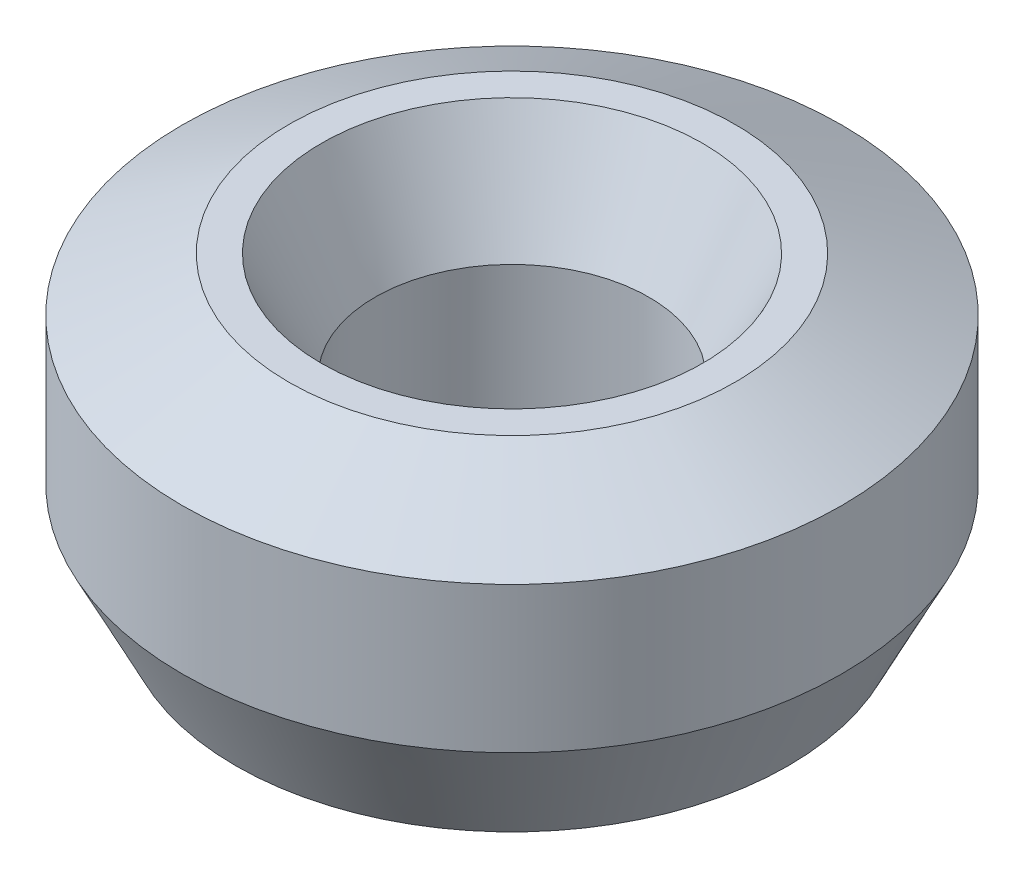
ISO-10303-21;
HEADER;
FILE_DESCRIPTION(('STEP AP214'),'2;1');
FILE_NAME('part.step','',(''),(''),'','','');
FILE_SCHEMA(('AUTOMOTIVE_DESIGN { 1 0 10303 214 1 1 1 1 }'));
ENDSEC;
DATA;
#1=APPLICATION_CONTEXT('core data for automotive mechanical design processes');
#2=APPLICATION_PROTOCOL_DEFINITION('international standard','automotive_design',2000,#1);
#3=PRODUCT_CONTEXT('',#1,'mechanical');
#4=PRODUCT('Part','Part','',(#3));
#5=PRODUCT_RELATED_PRODUCT_CATEGORY('part','',(#4));
#6=PRODUCT_DEFINITION_FORMATION('','',#4);
#7=PRODUCT_DEFINITION_CONTEXT('part definition',#1,'design');
#8=PRODUCT_DEFINITION('design','',#6,#7);
#9=PRODUCT_DEFINITION_SHAPE('','',#8);
#10=(LENGTH_UNIT() NAMED_UNIT(*) SI_UNIT(.MILLI.,.METRE.));
#11=(NAMED_UNIT(*) PLANE_ANGLE_UNIT() SI_UNIT($,.RADIAN.));
#12=(NAMED_UNIT(*) SI_UNIT($,.STERADIAN.) SOLID_ANGLE_UNIT());
#13=UNCERTAINTY_MEASURE_WITH_UNIT(LENGTH_MEASURE(1.E-05),#10,'distance_accuracy_value','');
#14=(GEOMETRIC_REPRESENTATION_CONTEXT(3) GLOBAL_UNCERTAINTY_ASSIGNED_CONTEXT((#13)) GLOBAL_UNIT_ASSIGNED_CONTEXT((#10,
#11,#12)) REPRESENTATION_CONTEXT('',''));
#15=CARTESIAN_POINT('',(0.,0.,0.));
#16=DIRECTION('',(0.,0.,1.));
#17=DIRECTION('',(1.,0.,0.));
#18=AXIS2_PLACEMENT_3D('',#15,#16,#17);
#19=CARTESIAN_POINT('',(0.,16.2372618675836,0.));
#20=DIRECTION('',(0.,-1.,0.));
#21=DIRECTION('',(0.,0.,-1.));
#22=AXIS2_PLACEMENT_3D('',#19,#20,#21);
#23=CYLINDRICAL_SURFACE('',#22,17.5);
#24=CARTESIAN_POINT('',(0.,5.65059288339666,0.));
#25=DIRECTION('',(0.,1.,0.));
#26=DIRECTION('',(0.,0.,1.));
#27=AXIS2_PLACEMENT_3D('',#24,#25,#26);
#28=CIRCLE('',#27,17.5);
#29=CARTESIAN_POINT('',(0.,5.65059288339666,17.5));
#30=VERTEX_POINT('',#29);
#31=EDGE_CURVE('E10',#30,#30,#28,.T.);
#32=ORIENTED_EDGE('',*,*,#31,.T.);
#33=EDGE_LOOP('',(#32));
#34=FACE_BOUND('',#33,.T.);
#35=CARTESIAN_POINT('',(0.,13.390682589658,0.));
#36=DIRECTION('',(0.,1.,0.));
#37=DIRECTION('',(0.,0.,1.));
#38=AXIS2_PLACEMENT_3D('',#35,#36,#37);
#39=CIRCLE('',#38,17.5);
#40=CARTESIAN_POINT('',(0.,13.390682589658,17.5));
#41=VERTEX_POINT('',#40);
#42=EDGE_CURVE('E50',#41,#41,#39,.F.);
#43=ORIENTED_EDGE('',*,*,#42,.T.);
#44=EDGE_LOOP('',(#43));
#45=FACE_BOUND('',#44,.T.);
#46=ADVANCED_FACE('F39',(#34,#45),#23,.T.);
#47=CARTESIAN_POINT('',(0.,16.2372618675836,0.));
#48=DIRECTION('',(0.,1.,0.));
#49=DIRECTION('',(0.,0.,1.));
#50=AXIS2_PLACEMENT_3D('',#47,#48,#49);
#51=PLANE('',#50);
#52=CARTESIAN_POINT('',(0.,16.2372618675836,0.));
#53=DIRECTION('',(0.,1.,0.));
#54=DIRECTION('',(0.,0.,1.));
#55=AXIS2_PLACEMENT_3D('',#52,#53,#54);
#56=CIRCLE('',#55,10.1187402259934);
#57=CARTESIAN_POINT('',(0.,16.2372618675836,10.1187402259934));
#58=VERTEX_POINT('',#57);
#59=EDGE_CURVE('E58',#58,#58,#56,.F.);
#60=ORIENTED_EDGE('',*,*,#59,.T.);
#61=EDGE_LOOP('',(#60));
#62=FACE_BOUND('',#61,.T.);
#63=CARTESIAN_POINT('',(0.,16.2372618675836,0.));
#64=DIRECTION('',(0.,1.,0.));
#65=DIRECTION('',(0.,0.,1.));
#66=AXIS2_PLACEMENT_3D('',#63,#64,#65);
#67=CIRCLE('',#66,11.8494071166033);
#68=CARTESIAN_POINT('',(0.,16.2372618675836,11.8494071166033));
#69=VERTEX_POINT('',#68);
#70=EDGE_CURVE('E61',#69,#69,#67,.T.);
#71=ORIENTED_EDGE('',*,*,#70,.T.);
#72=EDGE_LOOP('',(#71));
#73=FACE_BOUND('',#72,.T.);
#74=ADVANCED_FACE('F88',(#62,#73),#51,.T.);
#75=CARTESIAN_POINT('',(0.,0.,0.));
#76=DIRECTION('',(0.,1.,0.));
#77=DIRECTION('',(0.,0.,1.));
#78=AXIS2_PLACEMENT_3D('',#75,#76,#77);
#79=PLANE('',#78);
#80=CARTESIAN_POINT('',(0.,0.,0.));
#81=DIRECTION('',(0.,1.,0.));
#82=DIRECTION('',(0.,0.,1.));
#83=AXIS2_PLACEMENT_3D('',#80,#81,#82);
#84=CIRCLE('',#83,12.9227538314645);
#85=CARTESIAN_POINT('',(0.,0.,12.9227538314645));
#86=VERTEX_POINT('',#85);
#87=EDGE_CURVE('E51',#86,#86,#84,.T.);
#88=ORIENTED_EDGE('',*,*,#87,.T.);
#89=EDGE_LOOP('',(#88));
#90=FACE_BOUND('',#89,.T.);
#91=CARTESIAN_POINT('',(0.,0.,0.));
#92=DIRECTION('',(0.,1.,0.));
#93=DIRECTION('',(0.,0.,1.));
#94=AXIS2_PLACEMENT_3D('',#91,#92,#93);
#95=CIRCLE('',#94,14.6534207220744);
#96=CARTESIAN_POINT('',(0.,0.,14.6534207220744));
#97=VERTEX_POINT('',#96);
#98=EDGE_CURVE('E54',#97,#97,#95,.F.);
#99=ORIENTED_EDGE('',*,*,#98,.T.);
#100=EDGE_LOOP('',(#99));
#101=FACE_BOUND('',#100,.T.);
#102=ADVANCED_FACE('F83',(#90,#101),#79,.F.);
#103=CARTESIAN_POINT('',(0.,16.2372618675836,0.));
#104=DIRECTION('',(0.,-1.,0.));
#105=DIRECTION('',(0.,0.,-1.));
#106=AXIS2_PLACEMENT_3D('',#103,#104,#105);
#107=CYLINDRICAL_SURFACE('',#106,7.2721609480678);
#108=CARTESIAN_POINT('',(0.,10.5866689841869,0.));
#109=DIRECTION('',(0.,1.,0.));
#110=DIRECTION('',(0.,0.,1.));
#111=AXIS2_PLACEMENT_3D('',#108,#109,#110);
#112=CIRCLE('',#111,7.2721609480678);
#113=CARTESIAN_POINT('',(0.,10.5866689841869,7.2721609480678));
#114=VERTEX_POINT('',#113);
#115=EDGE_CURVE('E67',#114,#114,#112,.T.);
#116=ORIENTED_EDGE('',*,*,#115,.T.);
#117=EDGE_LOOP('',(#116));
#118=FACE_BOUND('',#117,.T.);
#119=CARTESIAN_POINT('',(0.,2.84657927792561,0.));
#120=DIRECTION('',(0.,1.,0.));
#121=DIRECTION('',(0.,0.,1.));
#122=AXIS2_PLACEMENT_3D('',#119,#120,#121);
#123=CIRCLE('',#122,7.2721609480678);
#124=CARTESIAN_POINT('',(0.,2.84657927792561,7.2721609480678));
#125=VERTEX_POINT('',#124);
#126=EDGE_CURVE('E69',#125,#125,#123,.F.);
#127=ORIENTED_EDGE('',*,*,#126,.T.);
#128=EDGE_LOOP('',(#127));
#129=FACE_BOUND('',#128,.T.);
#130=ADVANCED_FACE('F71',(#118,#129),#107,.F.);
#131=CARTESIAN_POINT('',(0.,10.5866689841869,0.));
#132=DIRECTION('',(0.,1.,0.));
#133=DIRECTION('',(0.,0.,1.));
#134=AXIS2_PLACEMENT_3D('',#131,#132,#133);
#135=CONICAL_SURFACE('',#134,7.2721609480678,0.466656249862898);
#136=ORIENTED_EDGE('',*,*,#59,.F.);
#137=EDGE_LOOP('',(#136));
#138=FACE_BOUND('',#137,.T.);
#139=ORIENTED_EDGE('',*,*,#115,.F.);
#140=EDGE_LOOP('',(#139));
#141=FACE_BOUND('',#140,.T.);
#142=ADVANCED_FACE('F77',(#138,#141),#135,.F.);
#143=CARTESIAN_POINT('',(0.,0.,0.));
#144=DIRECTION('',(0.,-1.,0.));
#145=DIRECTION('',(0.,0.,-1.));
#146=AXIS2_PLACEMENT_3D('',#143,#144,#145);
#147=CONICAL_SURFACE('',#146,12.9227538314645,1.104140076932);
#148=ORIENTED_EDGE('',*,*,#126,.F.);
#149=EDGE_LOOP('',(#148));
#150=FACE_BOUND('',#149,.T.);
#151=ORIENTED_EDGE('',*,*,#87,.F.);
#152=EDGE_LOOP('',(#151));
#153=FACE_BOUND('',#152,.T.);
#154=ADVANCED_FACE('F73',(#150,#153),#147,.F.);
#155=CARTESIAN_POINT('',(0.,5.65059288339666,0.));
#156=DIRECTION('',(0.,1.,0.));
#157=DIRECTION('',(0.,0.,1.));
#158=AXIS2_PLACEMENT_3D('',#155,#156,#157);
#159=CONICAL_SURFACE('',#158,17.5,0.466656249862897);
#160=ORIENTED_EDGE('',*,*,#98,.F.);
#161=EDGE_LOOP('',(#160));
#162=FACE_BOUND('',#161,.T.);
#163=ORIENTED_EDGE('',*,*,#31,.F.);
#164=EDGE_LOOP('',(#163));
#165=FACE_BOUND('',#164,.T.);
#166=ADVANCED_FACE('F76',(#162,#165),#159,.T.);
#167=CARTESIAN_POINT('',(0.,16.2372618675836,0.));
#168=DIRECTION('',(0.,-1.,0.));
#169=DIRECTION('',(0.,0.,-1.));
#170=AXIS2_PLACEMENT_3D('',#167,#168,#169);
#171=CONICAL_SURFACE('',#170,11.8494071166033,1.104140076932);
#172=ORIENTED_EDGE('',*,*,#42,.F.);
#173=EDGE_LOOP('',(#172));
#174=FACE_BOUND('',#173,.T.);
#175=ORIENTED_EDGE('',*,*,#70,.F.);
#176=EDGE_LOOP('',(#175));
#177=FACE_BOUND('',#176,.T.);
#178=ADVANCED_FACE('F45',(#174,#177),#171,.T.);
#179=CLOSED_SHELL('',(#46,#74,#102,#130,#142,#154,#166,#178));
#180=MANIFOLD_SOLID_BREP('B2',#179);
#181=ADVANCED_BREP_SHAPE_REPRESENTATION('',(#18,#180),#14);
#182=SHAPE_DEFINITION_REPRESENTATION(#9,#181);
ENDSEC;
END-ISO-10303-21;
